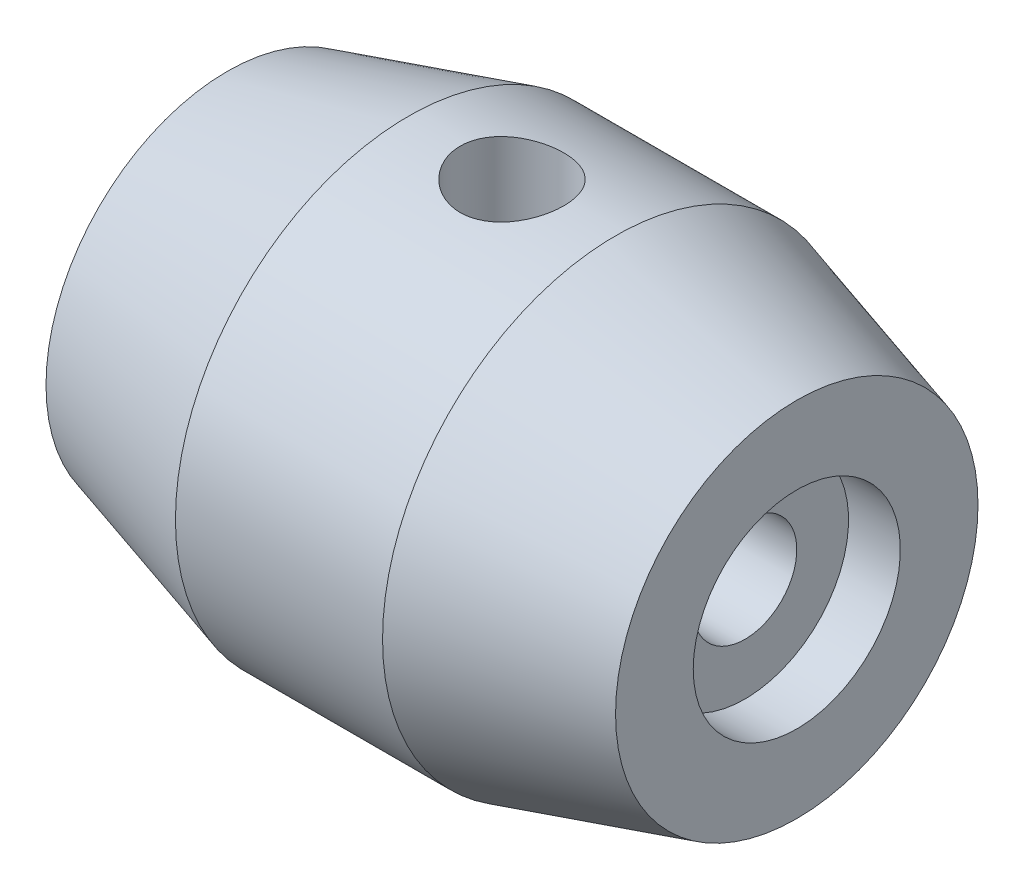
ISO-10303-21;
HEADER;
FILE_DESCRIPTION(('STEP AP214'),'2;1');
FILE_NAME('part.step','',(''),(''),'','','');
FILE_SCHEMA(('AUTOMOTIVE_DESIGN { 1 0 10303 214 1 1 1 1 }'));
ENDSEC;
DATA;
#1=APPLICATION_CONTEXT('core data for automotive mechanical design processes');
#2=APPLICATION_PROTOCOL_DEFINITION('international standard','automotive_design',2000,#1);
#3=PRODUCT_CONTEXT('',#1,'mechanical');
#4=PRODUCT('Part','Part','',(#3));
#5=PRODUCT_RELATED_PRODUCT_CATEGORY('part','',(#4));
#6=PRODUCT_DEFINITION_FORMATION('','',#4);
#7=PRODUCT_DEFINITION_CONTEXT('part definition',#1,'design');
#8=PRODUCT_DEFINITION('design','',#6,#7);
#9=PRODUCT_DEFINITION_SHAPE('','',#8);
#10=(LENGTH_UNIT() NAMED_UNIT(*) SI_UNIT(.MILLI.,.METRE.));
#11=(NAMED_UNIT(*) PLANE_ANGLE_UNIT() SI_UNIT($,.RADIAN.));
#12=(NAMED_UNIT(*) SI_UNIT($,.STERADIAN.) SOLID_ANGLE_UNIT());
#13=UNCERTAINTY_MEASURE_WITH_UNIT(LENGTH_MEASURE(1.E-05),#10,'distance_accuracy_value','');
#14=(GEOMETRIC_REPRESENTATION_CONTEXT(3) GLOBAL_UNCERTAINTY_ASSIGNED_CONTEXT((#13)) GLOBAL_UNIT_ASSIGNED_CONTEXT((#10,
#11,#12)) REPRESENTATION_CONTEXT('',''));
#15=CARTESIAN_POINT('',(0.,0.,0.));
#16=DIRECTION('',(0.,0.,1.));
#17=DIRECTION('',(1.,0.,0.));
#18=AXIS2_PLACEMENT_3D('',#15,#16,#17);
#19=CARTESIAN_POINT('',(0.,0.,0.5));
#20=DIRECTION('',(-1.,0.,0.));
#21=DIRECTION('',(0.,0.,1.));
#22=AXIS2_PLACEMENT_3D('',#19,#20,#21);
#23=CYLINDRICAL_SURFACE('',#22,0.5);
#24=CARTESIAN_POINT('',(0.,0.,0.5));
#25=DIRECTION('',(-1.,0.,0.));
#26=DIRECTION('',(0.,0.,1.));
#27=AXIS2_PLACEMENT_3D('',#24,#25,#26);
#28=CIRCLE('',#27,0.5);
#29=CARTESIAN_POINT('',(0.,0.,1.));
#30=VERTEX_POINT('',#29);
#31=EDGE_CURVE('E95',#30,#30,#28,.T.);
#32=ORIENTED_EDGE('',*,*,#31,.T.);
#33=EDGE_LOOP('',(#32));
#34=FACE_BOUND('',#33,.T.);
#35=CARTESIAN_POINT('',(2.25,0.,0.5));
#36=DIRECTION('',(-0.707106781186547,-0.707106781186547,0.));
#37=DIRECTION('',(-0.707106781186547,0.707106781186547,0.));
#38=AXIS2_PLACEMENT_3D('',#35,#36,#37);
#39=ELLIPSE('',#38,0.707106781186547,0.5);
#40=CARTESIAN_POINT('',(2.25,0.,0.));
#41=VERTEX_POINT('',#40);
#42=CARTESIAN_POINT('',(2.25,0.,1.));
#43=VERTEX_POINT('',#42);
#44=EDGE_CURVE('E52',#41,#43,#39,.F.);
#45=ORIENTED_EDGE('',*,*,#44,.T.);
#46=CARTESIAN_POINT('',(2.25,0.,0.5));
#47=DIRECTION('',(-0.707106781186547,0.707106781186547,0.));
#48=DIRECTION('',(-0.707106781186547,-0.707106781186547,0.));
#49=AXIS2_PLACEMENT_3D('',#46,#47,#48);
#50=ELLIPSE('',#49,0.707106781186547,0.5);
#51=EDGE_CURVE('E11',#43,#41,#50,.F.);
#52=ORIENTED_EDGE('',*,*,#51,.T.);
#53=EDGE_LOOP('',(#45,#52));
#54=FACE_BOUND('',#53,.T.);
#55=ADVANCED_FACE('F39',(#34,#54),#23,.F.);
#56=CARTESIAN_POINT('',(0.,0.,0.5));
#57=DIRECTION('',(-1.,0.,0.));
#58=DIRECTION('',(0.,0.,1.));
#59=AXIS2_PLACEMENT_3D('',#56,#57,#58);
#60=CYLINDRICAL_SURFACE('',#59,1.);
#61=CARTESIAN_POINT('',(0.,0.,0.5));
#62=DIRECTION('',(-1.,0.,0.));
#63=DIRECTION('',(0.,0.,1.));
#64=AXIS2_PLACEMENT_3D('',#61,#62,#63);
#65=CIRCLE('',#64,1.);
#66=CARTESIAN_POINT('',(0.,0.,1.5));
#67=VERTEX_POINT('',#66);
#68=EDGE_CURVE('E98',#67,#67,#65,.T.);
#69=ORIENTED_EDGE('',*,*,#68,.F.);
#70=EDGE_LOOP('',(#69));
#71=FACE_BOUND('',#70,.T.);
#72=CARTESIAN_POINT('',(-0.5,0.,0.5));
#73=DIRECTION('',(-1.,0.,0.));
#74=DIRECTION('',(0.,0.,1.));
#75=AXIS2_PLACEMENT_3D('',#72,#73,#74);
#76=CIRCLE('',#75,1.);
#77=CARTESIAN_POINT('',(-0.5,0.,1.5));
#78=VERTEX_POINT('',#77);
#79=EDGE_CURVE('E67',#78,#78,#76,.T.);
#80=ORIENTED_EDGE('',*,*,#79,.T.);
#81=EDGE_LOOP('',(#80));
#82=FACE_BOUND('',#81,.T.);
#83=ADVANCED_FACE('F41',(#71,#82),#60,.F.);
#84=CARTESIAN_POINT('',(-0.5,0.,-1.25));
#85=DIRECTION('',(1.,0.,0.));
#86=DIRECTION('',(0.,0.,-1.));
#87=AXIS2_PLACEMENT_3D('',#84,#85,#86);
#88=PLANE('',#87);
#89=ORIENTED_EDGE('',*,*,#79,.F.);
#90=EDGE_LOOP('',(#89));
#91=FACE_BOUND('',#90,.T.);
#92=CARTESIAN_POINT('',(-0.5,0.,0.5));
#93=DIRECTION('',(-1.,0.,0.));
#94=DIRECTION('',(0.,0.,1.));
#95=AXIS2_PLACEMENT_3D('',#92,#93,#94);
#96=CIRCLE('',#95,1.75);
#97=CARTESIAN_POINT('',(-0.5,0.,2.25));
#98=VERTEX_POINT('',#97);
#99=EDGE_CURVE('E74',#98,#98,#96,.T.);
#100=ORIENTED_EDGE('',*,*,#99,.T.);
#101=EDGE_LOOP('',(#100));
#102=FACE_BOUND('',#101,.T.);
#103=ADVANCED_FACE('F153',(#91,#102),#88,.F.);
#104=CARTESIAN_POINT('',(1.25,0.,0.5));
#105=DIRECTION('',(1.,0.,0.));
#106=DIRECTION('',(0.,0.,-1.));
#107=AXIS2_PLACEMENT_3D('',#104,#105,#106);
#108=CONICAL_SURFACE('',#107,2.25,0.278299659005111);
#109=ORIENTED_EDGE('',*,*,#99,.F.);
#110=EDGE_LOOP('',(#109));
#111=FACE_BOUND('',#110,.T.);
#112=CARTESIAN_POINT('',(1.25,0.,0.5));
#113=DIRECTION('',(-1.,0.,0.));
#114=DIRECTION('',(0.,0.,1.));
#115=AXIS2_PLACEMENT_3D('',#112,#113,#114);
#116=CIRCLE('',#115,2.25);
#117=CARTESIAN_POINT('',(1.25,0.,2.75));
#118=VERTEX_POINT('',#117);
#119=EDGE_CURVE('E77',#118,#118,#116,.T.);
#120=ORIENTED_EDGE('',*,*,#119,.T.);
#121=EDGE_LOOP('',(#120));
#122=FACE_BOUND('',#121,.T.);
#123=ADVANCED_FACE('F144',(#111,#122),#108,.T.);
#124=CARTESIAN_POINT('',(0.,0.,0.5));
#125=DIRECTION('',(-1.,0.,0.));
#126=DIRECTION('',(0.,0.,1.));
#127=AXIS2_PLACEMENT_3D('',#124,#125,#126);
#128=CYLINDRICAL_SURFACE('',#127,2.25);
#129=CARTESIAN_POINT('',(1.75,-2.25,0.5));
#130=CARTESIAN_POINT('',(1.75000093091996,-2.24999949054563,0.527720119193912));
#131=CARTESIAN_POINT('',(1.75231299541587,-2.24948253498923,0.555451391317405));
#132=CARTESIAN_POINT('',(1.76149011808764,-2.24747024439417,0.610125486025783));
#133=CARTESIAN_POINT('',(1.76835835850232,-2.24597422554337,0.637067743784747));
#134=CARTESIAN_POINT('',(1.78642149262291,-2.24217028292252,0.689365819440382));
#135=CARTESIAN_POINT('',(1.79761179424947,-2.23986322109771,0.714723288025071));
#136=CARTESIAN_POINT('',(1.8239866531181,-2.23468583860344,0.76320004507844));
#137=CARTESIAN_POINT('',(1.83917113282265,-2.2318155288684,0.786319376983337));
#138=CARTESIAN_POINT('',(1.87336891627667,-2.22577273543553,0.830046578503509));
#139=CARTESIAN_POINT('',(1.89243562553379,-2.22259640410357,0.850612153010884));
#140=CARTESIAN_POINT('',(1.93374201502328,-2.21632650269947,0.888281227614593));
#141=CARTESIAN_POINT('',(1.95598198517761,-2.21323294022012,0.905384411027138));
#142=CARTESIAN_POINT('',(2.00331796101457,-2.20744082065428,0.935831108525876));
#143=CARTESIAN_POINT('',(2.02844373951038,-2.20474718935745,0.949129355261009));
#144=CARTESIAN_POINT('',(2.08064319042311,-2.20011524088099,0.97129824738627));
#145=CARTESIAN_POINT('',(2.10771662137606,-2.19817683026193,0.98016944055024));
#146=CARTESIAN_POINT('',(2.16258336933067,-2.19531402364797,0.993092145016011));
#147=CARTESIAN_POINT('',(2.19035817877636,-2.19437386451946,0.997218667595172));
#148=CARTESIAN_POINT('',(2.24622055444655,-2.19356668432667,1.00076817749418));
#149=CARTESIAN_POINT('',(2.27430808049054,-2.19369952694735,1.00019176227916));
#150=CARTESIAN_POINT('',(2.32943915679845,-2.19500908037036,0.994412068793254));
#151=CARTESIAN_POINT('',(2.35649240603484,-2.1961660784621,0.989296161150543));
#152=CARTESIAN_POINT('',(2.40934678583125,-2.19936238547919,0.974721226702865));
#153=CARTESIAN_POINT('',(2.43514784402135,-2.20140174533294,0.965261949204129));
#154=CARTESIAN_POINT('',(2.48500985959547,-2.20615227492574,0.942189182182187));
#155=CARTESIAN_POINT('',(2.50905483183402,-2.20886881090622,0.928542298448382));
#156=CARTESIAN_POINT('',(2.55454571762897,-2.21466434477686,0.897505170349624));
#157=CARTESIAN_POINT('',(2.57599126545504,-2.21774339355149,0.880114400185685));
#158=CARTESIAN_POINT('',(2.61617732733712,-2.22400143653167,0.841621709257457));
#159=CARTESIAN_POINT('',(2.63484669627626,-2.22718112671968,0.820445551316558));
#160=CARTESIAN_POINT('',(2.66838093222678,-2.23321959780579,0.775226654522905));
#161=CARTESIAN_POINT('',(2.68324572594547,-2.23607837252107,0.751183860459343));
#162=CARTESIAN_POINT('',(2.7087673189442,-2.24116266058402,0.700825797683684));
#163=CARTESIAN_POINT('',(2.71941456107706,-2.24338673251915,0.674505530579963));
#164=CARTESIAN_POINT('',(2.73611525326447,-2.24694034091564,0.620388982745364));
#165=CARTESIAN_POINT('',(2.74216939335353,-2.24827001174196,0.592592924398341));
#166=CARTESIAN_POINT('',(2.74940800331379,-2.24986579440418,0.536923870820211));
#167=CARTESIAN_POINT('',(2.75068962504042,-2.25015312155572,0.509064099329726));
#168=CARTESIAN_POINT('',(2.74861047393491,-2.24969139662649,0.45352851901798));
#169=CARTESIAN_POINT('',(2.74525002667014,-2.24894241722615,0.425852697432338));
#170=CARTESIAN_POINT('',(2.73406264620797,-2.24650564689653,0.371794185667644));
#171=CARTESIAN_POINT('',(2.72628688594414,-2.2448286175194,0.345400377071129));
#172=CARTESIAN_POINT('',(2.70654657813873,-2.24072355271699,0.294291798536042));
#173=CARTESIAN_POINT('',(2.6945816659235,-2.23829545191165,0.269577174997455));
#174=CARTESIAN_POINT('',(2.66660178080025,-2.2329053830691,0.222128390026405));
#175=CARTESIAN_POINT('',(2.65053001424846,-2.22993611147562,0.199428567291938));
#176=CARTESIAN_POINT('',(2.61486718772464,-2.2238075808727,0.15701325875297));
#177=CARTESIAN_POINT('',(2.59527565491697,-2.22064829637544,0.137298174566468));
#178=CARTESIAN_POINT('',(2.55268299160482,-2.21442219736453,0.101026129522537));
#179=CARTESIAN_POINT('',(2.52962397749835,-2.21135829416071,0.0845365451498171));
#180=CARTESIAN_POINT('',(2.4810069913973,-2.20573848844577,0.0556634701931202));
#181=CARTESIAN_POINT('',(2.45544912866448,-2.20318256373818,0.0432798001825662));
#182=CARTESIAN_POINT('',(2.40269792772372,-2.19889300137232,0.0230549952593523));
#183=CARTESIAN_POINT('',(2.37551488943279,-2.19715469914947,0.0151880341131025));
#184=CARTESIAN_POINT('',(2.32016895378438,-2.19468912424348,0.0041449308539855));
#185=CARTESIAN_POINT('',(2.29200621974351,-2.19396168386833,0.000968010704109686));
#186=CARTESIAN_POINT('',(2.23618028043042,-2.19361100362244,-0.000570891602609773));
#187=CARTESIAN_POINT('',(2.20852012298498,-2.19396324592531,0.000960217140166759));
#188=CARTESIAN_POINT('',(2.15386257250829,-2.19567666239387,0.00855430719578082));
#189=CARTESIAN_POINT('',(2.12686517114413,-2.19703782386758,0.0146172314994017));
#190=CARTESIAN_POINT('',(2.07438771994316,-2.20060357032881,0.0310504500481394));
#191=CARTESIAN_POINT('',(2.0489024207796,-2.20280501295692,0.0414047084288665));
#192=CARTESIAN_POINT('',(2.00001500186332,-2.20780441117264,0.0661130741291453));
#193=CARTESIAN_POINT('',(1.976613107509,-2.21060243119158,0.0804676135370166));
#194=CARTESIAN_POINT('',(1.93203084776301,-2.21655260708832,0.113121602523605));
#195=CARTESIAN_POINT('',(1.91090694876934,-2.21971092841935,0.131497036222404));
#196=CARTESIAN_POINT('',(1.87200748151717,-2.22598493543347,0.17151782351374));
#197=CARTESIAN_POINT('',(1.8542326898729,-2.22910061107263,0.193163933441642));
#198=CARTESIAN_POINT('',(1.82230600427002,-2.23498814931645,0.239463507338609));
#199=CARTESIAN_POINT('',(1.80820620006627,-2.23775480874807,0.264153590841263));
#200=CARTESIAN_POINT('',(1.7843791739547,-2.24258014592312,0.315609930055296));
#201=CARTESIAN_POINT('',(1.77464833998846,-2.24463940817704,0.342374449171752));
#202=CARTESIAN_POINT('',(1.7615396624308,-2.24745703227389,0.390965438067648));
#203=CARTESIAN_POINT('',(1.75722065658343,-2.24840467255803,0.41253200202458));
#204=CARTESIAN_POINT('',(1.75145052392346,-2.24967634364947,0.456063387526368));
#205=CARTESIAN_POINT('',(1.74999926212452,-2.25000040380903,0.47802819027678));
#206=CARTESIAN_POINT('',(1.75,-2.25,0.5));
#207=B_SPLINE_CURVE_WITH_KNOTS('',3,(#129,#130,#131,#132,#133,#134,#135,#136,#137,#138,#139,
#140,#141,#142,#143,#144,#145,#146,#147,#148,#149,#150,#151,#152,#153,#154,#155,#156,#157,#158,
#159,#160,#161,#162,#163,#164,#165,#166,#167,#168,#169,#170,#171,#172,#173,#174,#175,#176,#177,
#178,#179,#180,#181,#182,#183,#184,#185,#186,#187,#188,#189,#190,#191,#192,#193,#194,#195,#196,
#197,#198,#199,#200,#201,#202,#203,#204,#205,#206),.UNSPECIFIED.,.T.,.F.,(4,2,2,2,2,2,2,2,2,2,2,
2,2,2,2,2,2,2,2,2,2,2,2,2,2,2,2,2,2,2,2,2,2,2,2,2,2,2,4),(0.,0.0830799224324491,
0.166217932812321,0.249267853101865,0.332316161292473,0.416595180005198,0.500881903726285,
0.586133240744939,0.671374026719349,0.755247814095267,0.839110946241476,0.921394170364459,
1.00368214436735,1.08664417427395,1.16961786314575,1.25444544952244,1.33927466992457,
1.42429503202809,1.50930261875497,1.59256998031067,1.67583150228067,1.75814717356292,
1.84047001236365,1.9239995081551,2.00754023346939,2.09267368276432,2.17780341127603,
2.26244139763811,2.34706534171603,2.42978196285604,2.51249754345715,2.59490678003945,
2.67732492146596,2.76146081578206,2.84561619616603,2.93090646762392,3.01612609467734,
3.08198086839639,3.14783254221988),.UNSPECIFIED.);
#208=CARTESIAN_POINT('',(1.75,-2.25,0.5));
#209=VERTEX_POINT('',#208);
#210=EDGE_CURVE('E101',#209,#209,#207,.T.);
#211=ORIENTED_EDGE('',*,*,#210,.T.);
#212=EDGE_LOOP('',(#211));
#213=FACE_BOUND('',#212,.T.);
#214=CARTESIAN_POINT('',(2.25,2.19374109684803,1.));
#215=CARTESIAN_POINT('',(2.22228940807663,2.19374165671196,0.999999062370393));
#216=CARTESIAN_POINT('',(2.19456764685176,2.19427186382925,0.997688532867662));
#217=CARTESIAN_POINT('',(2.13991329349285,2.19633134806857,0.988518059169195));
#218=CARTESIAN_POINT('',(2.112981274149,2.19786133246228,0.981654894254019));
#219=CARTESIAN_POINT('',(2.06070489442727,2.20173873082426,0.96360659577944));
#220=CARTESIAN_POINT('',(2.03535879649848,2.20408523102994,0.952426292001187));
#221=CARTESIAN_POINT('',(1.98690124823714,2.20933016580209,0.926075008588614));
#222=CARTESIAN_POINT('',(1.96378976706465,2.21222859274977,0.910904084039621));
#223=CARTESIAN_POINT('',(1.92005435715751,2.2183072581998,0.876720268647715));
#224=CARTESIAN_POINT('',(1.89947505946996,2.22149119956244,0.857650924448024));
#225=CARTESIAN_POINT('',(1.86177931189035,2.22774975862021,0.816333419715936));
#226=CARTESIAN_POINT('',(1.84466313658911,2.23082436763047,0.794085007353801));
#227=CARTESIAN_POINT('',(1.81420231215114,2.23655823200368,0.746740986309384));
#228=CARTESIAN_POINT('',(1.80090068763671,2.23921260851842,0.721617054133267));
#229=CARTESIAN_POINT('',(1.77872504956989,2.24376506083888,0.669421583912988));
#230=CARTESIAN_POINT('',(1.76985052288225,2.24566322429048,0.642350272001739));
#231=CARTESIAN_POINT('',(1.75692164176529,2.24846321116809,0.587492699082083));
#232=CARTESIAN_POINT('',(1.7527917226999,2.24938063731732,0.55972505706548));
#233=CARTESIAN_POINT('',(1.74923293228189,2.25016987238011,0.503876914446506));
#234=CARTESIAN_POINT('',(1.74980350651655,2.25004180460736,0.475796451130864));
#235=CARTESIAN_POINT('',(1.75557343062401,2.2487663733782,0.420641019766413));
#236=CARTESIAN_POINT('',(1.76069131977278,2.24763694901169,0.393557053918212));
#237=CARTESIAN_POINT('',(1.77528066688879,2.24450619325576,0.340642288614146));
#238=CARTESIAN_POINT('',(1.78475232581331,2.24250482162004,0.314811547064298));
#239=CARTESIAN_POINT('',(1.80785174352524,2.23782634651414,0.264911557652267));
#240=CARTESIAN_POINT('',(1.82151017913611,2.23514428138198,0.240856994776494));
#241=CARTESIAN_POINT('',(1.85257252348725,2.22939817921004,0.195351715863798));
#242=CARTESIAN_POINT('',(1.86997695776749,2.2263340885999,0.173901365842616));
#243=CARTESIAN_POINT('',(1.90848004846324,2.22008291431706,0.133728752604793));
#244=CARTESIAN_POINT('',(1.92964999399271,2.21689460240035,0.115074945380947));
#245=CARTESIAN_POINT('',(1.97485068690427,2.21081580360458,0.081569242448634));
#246=CARTESIAN_POINT('',(1.99888151694357,2.20792532533511,0.0667174566279668));
#247=CARTESIAN_POINT('',(2.04923497208717,2.20276608391272,0.04120558521007));
#248=CARTESIAN_POINT('',(2.07556455570117,2.2004993012074,0.0305588063981751));
#249=CARTESIAN_POINT('',(2.12970154282057,2.19687128522591,0.0138618261920798));
#250=CARTESIAN_POINT('',(2.15750870271433,2.19550990317128,0.00781086957381356));
#251=CARTESIAN_POINT('',(2.21318499676493,2.19387727123657,0.000584252749492569));
#252=CARTESIAN_POINT('',(2.24104053275997,2.19358370062715,-0.00069124691949097));
#253=CARTESIAN_POINT('',(2.29656623074064,2.19405966131373,0.00139863143913393));
#254=CARTESIAN_POINT('',(2.32423640576461,2.19482911703023,0.00476367953105268));
#255=CARTESIAN_POINT('',(2.37825588437415,2.19732332068781,0.0159524066932598));
#256=CARTESIAN_POINT('',(2.40461724382407,2.19903620917258,0.0237207683639165));
#257=CARTESIAN_POINT('',(2.45566415778217,2.20321352126462,0.0434355621531912));
#258=CARTESIAN_POINT('',(2.48034954737487,2.20567801869957,0.0553824047249687));
#259=CARTESIAN_POINT('',(2.52777490044411,2.21112968512912,0.0833338245836311));
#260=CARTESIAN_POINT('',(2.55047782874627,2.21412451910994,0.0993997138228912));
#261=CARTESIAN_POINT('',(2.59290208935217,2.22027935503297,0.13505323926557));
#262=CARTESIAN_POINT('',(2.61262303825715,2.22343937814368,0.154641327617267));
#263=CARTESIAN_POINT('',(2.64891283587715,2.22964233481812,0.197235696346346));
#264=CARTESIAN_POINT('',(2.66541350896736,2.23268183182878,0.220300647540932));
#265=CARTESIAN_POINT('',(2.6943060335585,2.23823727860861,0.268932959464354));
#266=CARTESIAN_POINT('',(2.70669808015836,2.24075325323522,0.294500201296735));
#267=CARTESIAN_POINT('',(2.72692752865835,2.24496372179896,0.347249524999177));
#268=CARTESIAN_POINT('',(2.73479429897354,2.24666350054648,0.374419902956399));
#269=CARTESIAN_POINT('',(2.74584129000413,2.24907294174877,0.429738728301103));
#270=CARTESIAN_POINT('',(2.74902221517846,2.24978275303206,0.457887028018703));
#271=CARTESIAN_POINT('',(2.75057469559224,2.25012768800073,0.513716211385095));
#272=CARTESIAN_POINT('',(2.74904790766481,2.24978552807633,0.541394176434055));
#273=CARTESIAN_POINT('',(2.74145626236082,2.24811381615769,0.596088510341533));
#274=CARTESIAN_POINT('',(2.73539149172627,2.24678428303676,0.623104891835804));
#275=CARTESIAN_POINT('',(2.71894541070129,2.24328909266152,0.67562757119668));
#276=CARTESIAN_POINT('',(2.7085789440247,2.24112631248304,0.701138720660206));
#277=CARTESIAN_POINT('',(2.68383804911525,2.23619521829303,0.75007288202319));
#278=CARTESIAN_POINT('',(2.66946321845538,2.23342684348773,0.773495683947417));
#279=CARTESIAN_POINT('',(2.63678443063378,2.22751870654453,0.818082724877759));
#280=CARTESIAN_POINT('',(2.61840924107595,2.22437274873714,0.839193939599228));
#281=CARTESIAN_POINT('',(2.5783944658886,2.2180967679228,0.878067933087279));
#282=CARTESIAN_POINT('',(2.55675409105877,2.21496674895788,0.895829899994159));
#283=CARTESIAN_POINT('',(2.51046137504746,2.2090284254974,0.927739627858141));
#284=CARTESIAN_POINT('',(2.48577134579261,2.20622519807196,0.941833714658042));
#285=CARTESIAN_POINT('',(2.43431577613468,2.201322100761,0.965650065824727));
#286=CARTESIAN_POINT('',(2.4075519889674,2.1992216445463,0.975375976936397));
#287=CARTESIAN_POINT('',(2.35897338149001,2.19634405430348,0.988473373662163));
#288=CARTESIAN_POINT('',(2.33741914318318,2.19537451129345,0.992787455119522));
#289=CARTESIAN_POINT('',(2.29391226085341,2.1940728272804,0.998551065426962));
#290=CARTESIAN_POINT('',(2.27195963758,2.19374065317621,1.00000074303741));
#291=CARTESIAN_POINT('',(2.25,2.19374109684803,1.));
#292=B_SPLINE_CURVE_WITH_KNOTS('',3,(#214,#215,#216,#217,#218,#219,#220,#221,#222,#223,#224,
#225,#226,#227,#228,#229,#230,#231,#232,#233,#234,#235,#236,#237,#238,#239,#240,#241,#242,#243,
#244,#245,#246,#247,#248,#249,#250,#251,#252,#253,#254,#255,#256,#257,#258,#259,#260,#261,#262,
#263,#264,#265,#266,#267,#268,#269,#270,#271,#272,#273,#274,#275,#276,#277,#278,#279,#280,#281,
#282,#283,#284,#285,#286,#287,#288,#289,#290,#291),.UNSPECIFIED.,.T.,.F.,(4,2,2,2,2,2,2,2,2,2,2,
2,2,2,2,2,2,2,2,2,2,2,2,2,2,2,2,2,2,2,2,2,2,2,2,2,2,2,4),(0.,0.0830512792472959,
0.166161375096218,0.249178760004196,0.332194999025364,0.416511484783851,0.500834653375498,
0.586074531591765,0.67130452754291,0.755157428682217,0.839000439699948,0.921371104587025,
1.00374557184482,1.08673864500098,1.16974336915996,1.2545301182297,1.33931931756908,
1.42437472361056,1.50941614960817,1.59266937377633,1.67591667907559,1.75814064486148,
1.84037268979629,1.92390807180249,2.00745418499618,2.09261261509358,2.17776700084688,
2.26236232362383,2.34694492724075,2.42971396889789,2.51248142849315,2.59496562943308,
2.67745811450818,2.76156117362171,2.84568459323394,2.93097742882032,3.01619892523713,
3.08201746572614,3.14783258789567),.UNSPECIFIED.);
#293=CARTESIAN_POINT('',(2.25,2.19374109684803,1.));
#294=VERTEX_POINT('',#293);
#295=EDGE_CURVE('E109',#294,#294,#292,.T.);
#296=ORIENTED_EDGE('',*,*,#295,.T.);
#297=EDGE_LOOP('',(#296));
#298=FACE_BOUND('',#297,.T.);
#299=ORIENTED_EDGE('',*,*,#119,.F.);
#300=EDGE_LOOP('',(#299));
#301=FACE_BOUND('',#300,.T.);
#302=CARTESIAN_POINT('',(3.25,0.,0.5));
#303=DIRECTION('',(-1.,0.,0.));
#304=DIRECTION('',(0.,0.,1.));
#305=AXIS2_PLACEMENT_3D('',#302,#303,#304);
#306=CIRCLE('',#305,2.25);
#307=CARTESIAN_POINT('',(3.25,0.,2.75));
#308=VERTEX_POINT('',#307);
#309=EDGE_CURVE('E80',#308,#308,#306,.T.);
#310=ORIENTED_EDGE('',*,*,#309,.T.);
#311=EDGE_LOOP('',(#310));
#312=FACE_BOUND('',#311,.T.);
#313=ADVANCED_FACE('F113',(#213,#298,#301,#312),#128,.T.);
#314=CARTESIAN_POINT('',(5.,0.,0.5));
#315=DIRECTION('',(-1.,0.,0.));
#316=DIRECTION('',(0.,0.,1.));
#317=AXIS2_PLACEMENT_3D('',#314,#315,#316);
#318=CONICAL_SURFACE('',#317,1.75,0.278299659005111);
#319=ORIENTED_EDGE('',*,*,#309,.F.);
#320=EDGE_LOOP('',(#319));
#321=FACE_BOUND('',#320,.T.);
#322=CARTESIAN_POINT('',(5.,0.,0.5));
#323=DIRECTION('',(-1.,0.,0.));
#324=DIRECTION('',(0.,0.,1.));
#325=AXIS2_PLACEMENT_3D('',#322,#323,#324);
#326=CIRCLE('',#325,1.75);
#327=CARTESIAN_POINT('',(5.,0.,2.25));
#328=VERTEX_POINT('',#327);
#329=EDGE_CURVE('E83',#328,#328,#326,.T.);
#330=ORIENTED_EDGE('',*,*,#329,.T.);
#331=EDGE_LOOP('',(#330));
#332=FACE_BOUND('',#331,.T.);
#333=ADVANCED_FACE('F137',(#321,#332),#318,.T.);
#334=CARTESIAN_POINT('',(5.,0.,-0.5));
#335=DIRECTION('',(-1.,0.,0.));
#336=DIRECTION('',(0.,0.,1.));
#337=AXIS2_PLACEMENT_3D('',#334,#335,#336);
#338=PLANE('',#337);
#339=ORIENTED_EDGE('',*,*,#329,.F.);
#340=EDGE_LOOP('',(#339));
#341=FACE_BOUND('',#340,.T.);
#342=CARTESIAN_POINT('',(5.,0.,0.5));
#343=DIRECTION('',(-1.,0.,0.));
#344=DIRECTION('',(0.,0.,1.));
#345=AXIS2_PLACEMENT_3D('',#342,#343,#344);
#346=CIRCLE('',#345,1.);
#347=CARTESIAN_POINT('',(5.,0.,1.5));
#348=VERTEX_POINT('',#347);
#349=EDGE_CURVE('E86',#348,#348,#346,.T.);
#350=ORIENTED_EDGE('',*,*,#349,.T.);
#351=EDGE_LOOP('',(#350));
#352=FACE_BOUND('',#351,.T.);
#353=ADVANCED_FACE('F134',(#341,#352),#338,.F.);
#354=CARTESIAN_POINT('',(0.,0.,0.5));
#355=DIRECTION('',(-1.,0.,0.));
#356=DIRECTION('',(0.,0.,1.));
#357=AXIS2_PLACEMENT_3D('',#354,#355,#356);
#358=CYLINDRICAL_SURFACE('',#357,1.);
#359=ORIENTED_EDGE('',*,*,#349,.F.);
#360=EDGE_LOOP('',(#359));
#361=FACE_BOUND('',#360,.T.);
#362=CARTESIAN_POINT('',(4.5,0.,0.5));
#363=DIRECTION('',(-1.,0.,0.));
#364=DIRECTION('',(0.,0.,1.));
#365=AXIS2_PLACEMENT_3D('',#362,#363,#364);
#366=CIRCLE('',#365,1.);
#367=CARTESIAN_POINT('',(4.5,0.,1.5));
#368=VERTEX_POINT('',#367);
#369=EDGE_CURVE('E89',#368,#368,#366,.T.);
#370=ORIENTED_EDGE('',*,*,#369,.T.);
#371=EDGE_LOOP('',(#370));
#372=FACE_BOUND('',#371,.T.);
#373=ADVANCED_FACE('F130',(#361,#372),#358,.F.);
#374=CARTESIAN_POINT('',(4.5,0.,0.));
#375=DIRECTION('',(-1.,0.,0.));
#376=DIRECTION('',(0.,0.,1.));
#377=AXIS2_PLACEMENT_3D('',#374,#375,#376);
#378=PLANE('',#377);
#379=ORIENTED_EDGE('',*,*,#369,.F.);
#380=EDGE_LOOP('',(#379));
#381=FACE_BOUND('',#380,.T.);
#382=CARTESIAN_POINT('',(4.5,0.,0.5));
#383=DIRECTION('',(-1.,0.,0.));
#384=DIRECTION('',(0.,0.,1.));
#385=AXIS2_PLACEMENT_3D('',#382,#383,#384);
#386=CIRCLE('',#385,0.5);
#387=CARTESIAN_POINT('',(4.5,0.,1.));
#388=VERTEX_POINT('',#387);
#389=EDGE_CURVE('E92',#388,#388,#386,.T.);
#390=ORIENTED_EDGE('',*,*,#389,.T.);
#391=EDGE_LOOP('',(#390));
#392=FACE_BOUND('',#391,.T.);
#393=ADVANCED_FACE('F127',(#381,#392),#378,.F.);
#394=CARTESIAN_POINT('',(2.25,0.,0.5));
#395=DIRECTION('',(-0.707106781186547,-0.707106781186547,0.));
#396=DIRECTION('',(-0.707106781186547,0.707106781186547,0.));
#397=AXIS2_PLACEMENT_3D('',#394,#395,#396);
#398=ELLIPSE('',#397,0.707106781186547,0.5);
#399=EDGE_CURVE('E58',#41,#43,#398,.T.);
#400=ORIENTED_EDGE('',*,*,#399,.T.);
#401=CARTESIAN_POINT('',(2.25,0.,0.5));
#402=DIRECTION('',(-0.707106781186547,0.707106781186547,0.));
#403=DIRECTION('',(-0.707106781186547,-0.707106781186547,0.));
#404=AXIS2_PLACEMENT_3D('',#401,#402,#403);
#405=ELLIPSE('',#404,0.707106781186547,0.5);
#406=EDGE_CURVE('E47',#43,#41,#405,.T.);
#407=ORIENTED_EDGE('',*,*,#406,.T.);
#408=EDGE_LOOP('',(#400,#407));
#409=FACE_BOUND('',#408,.T.);
#410=ORIENTED_EDGE('',*,*,#389,.F.);
#411=EDGE_LOOP('',(#410));
#412=FACE_BOUND('',#411,.T.);
#413=ADVANCED_FACE('F69',(#409,#412),#23,.F.);
#414=CARTESIAN_POINT('',(0.,0.,-0.5));
#415=DIRECTION('',(1.,0.,0.));
#416=DIRECTION('',(0.,0.,-1.));
#417=AXIS2_PLACEMENT_3D('',#414,#415,#416);
#418=PLANE('',#417);
#419=ORIENTED_EDGE('',*,*,#31,.F.);
#420=EDGE_LOOP('',(#419));
#421=FACE_BOUND('',#420,.T.);
#422=ORIENTED_EDGE('',*,*,#68,.T.);
#423=EDGE_LOOP('',(#422));
#424=FACE_BOUND('',#423,.T.);
#425=ADVANCED_FACE('F120',(#421,#424),#418,.F.);
#426=CARTESIAN_POINT('',(2.25,-2.25,0.5));
#427=DIRECTION('',(0.,1.,0.));
#428=DIRECTION('',(0.,0.,1.));
#429=AXIS2_PLACEMENT_3D('',#426,#427,#428);
#430=CYLINDRICAL_SURFACE('',#429,0.5);
#431=ORIENTED_EDGE('',*,*,#44,.F.);
#432=ORIENTED_EDGE('',*,*,#406,.F.);
#433=EDGE_LOOP('',(#431,#432));
#434=FACE_BOUND('',#433,.T.);
#435=ORIENTED_EDGE('',*,*,#295,.F.);
#436=EDGE_LOOP('',(#435));
#437=FACE_BOUND('',#436,.T.);
#438=ADVANCED_FACE('F65',(#434,#437),#430,.F.);
#439=ORIENTED_EDGE('',*,*,#399,.F.);
#440=ORIENTED_EDGE('',*,*,#51,.F.);
#441=EDGE_LOOP('',(#439,#440));
#442=FACE_BOUND('',#441,.T.);
#443=ORIENTED_EDGE('',*,*,#210,.F.);
#444=EDGE_LOOP('',(#443));
#445=FACE_BOUND('',#444,.T.);
#446=ADVANCED_FACE('F59',(#442,#445),#430,.F.);
#447=CLOSED_SHELL('',(#55,#83,#103,#123,#313,#333,#353,#373,#393,#413,#425,#438,#446));
#448=MANIFOLD_SOLID_BREP('B2',#447);
#449=ADVANCED_BREP_SHAPE_REPRESENTATION('',(#18,#448),#14);
#450=SHAPE_DEFINITION_REPRESENTATION(#9,#449);
ENDSEC;
END-ISO-10303-21;
